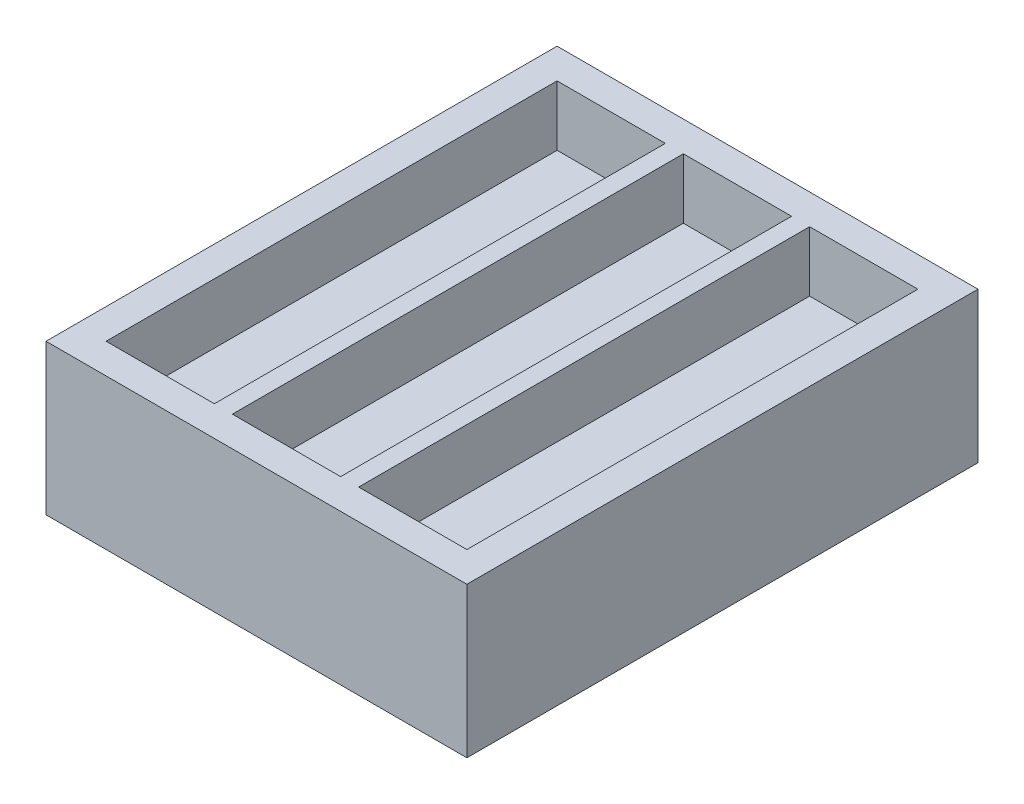
ISO-10303-21;
HEADER;
FILE_DESCRIPTION(('STEP AP214'),'2;1');
FILE_NAME('part.step','',(''),(''),'','','');
FILE_SCHEMA(('AUTOMOTIVE_DESIGN { 1 0 10303 214 1 1 1 1 }'));
ENDSEC;
DATA;
#1=APPLICATION_CONTEXT('core data for automotive mechanical design processes');
#2=APPLICATION_PROTOCOL_DEFINITION('international standard','automotive_design',2000,#1);
#3=PRODUCT_CONTEXT('',#1,'mechanical');
#4=PRODUCT('Part','Part','',(#3));
#5=PRODUCT_RELATED_PRODUCT_CATEGORY('part','',(#4));
#6=PRODUCT_DEFINITION_FORMATION('','',#4);
#7=PRODUCT_DEFINITION_CONTEXT('part definition',#1,'design');
#8=PRODUCT_DEFINITION('design','',#6,#7);
#9=PRODUCT_DEFINITION_SHAPE('','',#8);
#10=(LENGTH_UNIT() NAMED_UNIT(*) SI_UNIT(.MILLI.,.METRE.));
#11=(NAMED_UNIT(*) PLANE_ANGLE_UNIT() SI_UNIT($,.RADIAN.));
#12=(NAMED_UNIT(*) SI_UNIT($,.STERADIAN.) SOLID_ANGLE_UNIT());
#13=UNCERTAINTY_MEASURE_WITH_UNIT(LENGTH_MEASURE(1.E-05),#10,'distance_accuracy_value','');
#14=(GEOMETRIC_REPRESENTATION_CONTEXT(3) GLOBAL_UNCERTAINTY_ASSIGNED_CONTEXT((#13)) GLOBAL_UNIT_ASSIGNED_CONTEXT((#10,
#11,#12)) REPRESENTATION_CONTEXT('',''));
#15=CARTESIAN_POINT('',(0.,0.,0.));
#16=DIRECTION('',(0.,0.,1.));
#17=DIRECTION('',(1.,0.,0.));
#18=AXIS2_PLACEMENT_3D('',#15,#16,#17);
#19=CARTESIAN_POINT('',(35.,25.,42.5));
#20=DIRECTION('',(-1.,0.,0.));
#21=DIRECTION('',(0.,0.,1.));
#22=AXIS2_PLACEMENT_3D('',#19,#20,#21);
#23=PLANE('',#22);
#24=DIRECTION('',(0.,0.,-1.));
#25=VECTOR('',#24,1.);
#26=CARTESIAN_POINT('',(35.,0.,42.5));
#27=LINE('',#26,#25);
#28=CARTESIAN_POINT('',(35.,0.,42.5));
#29=VERTEX_POINT('',#28);
#30=CARTESIAN_POINT('',(35.,0.,-42.5));
#31=VERTEX_POINT('',#30);
#32=EDGE_CURVE('E184',#29,#31,#27,.T.);
#33=ORIENTED_EDGE('',*,*,#32,.T.);
#34=DIRECTION('',(0.,-1.,0.));
#35=VECTOR('',#34,1.);
#36=CARTESIAN_POINT('',(35.,25.,-42.5));
#37=LINE('',#36,#35);
#38=CARTESIAN_POINT('',(35.,25.,-42.5));
#39=VERTEX_POINT('',#38);
#40=EDGE_CURVE('E11',#39,#31,#37,.T.);
#41=ORIENTED_EDGE('',*,*,#40,.F.);
#42=DIRECTION('',(0.,0.,-1.));
#43=VECTOR('',#42,1.);
#44=CARTESIAN_POINT('',(35.,25.,42.5));
#45=LINE('',#44,#43);
#46=CARTESIAN_POINT('',(35.,25.,42.5));
#47=VERTEX_POINT('',#46);
#48=EDGE_CURVE('E250',#47,#39,#45,.T.);
#49=ORIENTED_EDGE('',*,*,#48,.F.);
#50=DIRECTION('',(0.,-1.,0.));
#51=VECTOR('',#50,1.);
#52=CARTESIAN_POINT('',(35.,25.,42.5));
#53=LINE('',#52,#51);
#54=EDGE_CURVE('E260',#47,#29,#53,.T.);
#55=ORIENTED_EDGE('',*,*,#54,.T.);
#56=EDGE_LOOP('',(#33,#41,#49,#55));
#57=FACE_BOUND('',#56,.T.);
#58=ADVANCED_FACE('F37',(#57),#23,.F.);
#59=CARTESIAN_POINT('',(-35.,25.,-42.5));
#60=DIRECTION('',(0.,0.,1.));
#61=DIRECTION('',(1.,0.,0.));
#62=AXIS2_PLACEMENT_3D('',#59,#60,#61);
#63=PLANE('',#62);
#64=DIRECTION('',(-1.,0.,0.));
#65=VECTOR('',#64,1.);
#66=CARTESIAN_POINT('',(-35.,0.,-42.5));
#67=LINE('',#66,#65);
#68=CARTESIAN_POINT('',(-35.,0.,-42.5));
#69=VERTEX_POINT('',#68);
#70=EDGE_CURVE('E263',#31,#69,#67,.T.);
#71=ORIENTED_EDGE('',*,*,#70,.T.);
#72=DIRECTION('',(0.,-1.,0.));
#73=VECTOR('',#72,1.);
#74=CARTESIAN_POINT('',(-35.,25.,-42.5));
#75=LINE('',#74,#73);
#76=CARTESIAN_POINT('',(-35.,25.,-42.5));
#77=VERTEX_POINT('',#76);
#78=EDGE_CURVE('E44',#77,#69,#75,.T.);
#79=ORIENTED_EDGE('',*,*,#78,.F.);
#80=DIRECTION('',(-1.,0.,0.));
#81=VECTOR('',#80,1.);
#82=CARTESIAN_POINT('',(-35.,25.,-42.5));
#83=LINE('',#82,#81);
#84=EDGE_CURVE('E253',#39,#77,#83,.T.);
#85=ORIENTED_EDGE('',*,*,#84,.F.);
#86=ORIENTED_EDGE('',*,*,#40,.T.);
#87=EDGE_LOOP('',(#71,#79,#85,#86));
#88=FACE_BOUND('',#87,.T.);
#89=ADVANCED_FACE('F293',(#88),#63,.F.);
#90=CARTESIAN_POINT('',(-35.,25.,42.5));
#91=DIRECTION('',(1.,0.,0.));
#92=DIRECTION('',(0.,0.,-1.));
#93=AXIS2_PLACEMENT_3D('',#90,#91,#92);
#94=PLANE('',#93);
#95=DIRECTION('',(0.,0.,1.));
#96=VECTOR('',#95,1.);
#97=CARTESIAN_POINT('',(-35.,0.,42.5));
#98=LINE('',#97,#96);
#99=CARTESIAN_POINT('',(-35.,0.,42.5));
#100=VERTEX_POINT('',#99);
#101=EDGE_CURVE('E265',#69,#100,#98,.T.);
#102=ORIENTED_EDGE('',*,*,#101,.T.);
#103=DIRECTION('',(0.,-1.,0.));
#104=VECTOR('',#103,1.);
#105=CARTESIAN_POINT('',(-35.,25.,42.5));
#106=LINE('',#105,#104);
#107=CARTESIAN_POINT('',(-35.,25.,42.5));
#108=VERTEX_POINT('',#107);
#109=EDGE_CURVE('E270',#108,#100,#106,.T.);
#110=ORIENTED_EDGE('',*,*,#109,.F.);
#111=DIRECTION('',(0.,0.,1.));
#112=VECTOR('',#111,1.);
#113=CARTESIAN_POINT('',(-35.,25.,42.5));
#114=LINE('',#113,#112);
#115=EDGE_CURVE('E256',#77,#108,#114,.T.);
#116=ORIENTED_EDGE('',*,*,#115,.F.);
#117=ORIENTED_EDGE('',*,*,#78,.T.);
#118=EDGE_LOOP('',(#102,#110,#116,#117));
#119=FACE_BOUND('',#118,.T.);
#120=ADVANCED_FACE('F277',(#119),#94,.F.);
#121=CARTESIAN_POINT('',(-35.,25.,42.5));
#122=DIRECTION('',(0.,0.,-1.));
#123=DIRECTION('',(-1.,0.,0.));
#124=AXIS2_PLACEMENT_3D('',#121,#122,#123);
#125=PLANE('',#124);
#126=DIRECTION('',(1.,0.,0.));
#127=VECTOR('',#126,1.);
#128=CARTESIAN_POINT('',(-35.,0.,42.5));
#129=LINE('',#128,#127);
#130=EDGE_CURVE('E254',#100,#29,#129,.T.);
#131=ORIENTED_EDGE('',*,*,#130,.T.);
#132=ORIENTED_EDGE('',*,*,#54,.F.);
#133=DIRECTION('',(1.,0.,0.));
#134=VECTOR('',#133,1.);
#135=CARTESIAN_POINT('',(-35.,25.,42.5));
#136=LINE('',#135,#134);
#137=EDGE_CURVE('E258',#108,#47,#136,.T.);
#138=ORIENTED_EDGE('',*,*,#137,.F.);
#139=ORIENTED_EDGE('',*,*,#109,.T.);
#140=EDGE_LOOP('',(#131,#132,#138,#139));
#141=FACE_BOUND('',#140,.T.);
#142=ADVANCED_FACE('F286',(#141),#125,.F.);
#143=CARTESIAN_POINT('',(0.,25.,0.));
#144=DIRECTION('',(0.,-1.,0.));
#145=DIRECTION('',(0.,0.,-1.));
#146=AXIS2_PLACEMENT_3D('',#143,#144,#145);
#147=PLANE('',#146);
#148=DIRECTION('',(1.,0.,0.));
#149=VECTOR('',#148,1.);
#150=CARTESIAN_POINT('',(-30.,25.,37.5));
#151=LINE('',#150,#149);
#152=CARTESIAN_POINT('',(-30.,25.,37.5));
#153=VERTEX_POINT('',#152);
#154=CARTESIAN_POINT('',(-12.,25.,37.5));
#155=VERTEX_POINT('',#154);
#156=EDGE_CURVE('E178',#153,#155,#151,.T.);
#157=ORIENTED_EDGE('',*,*,#156,.F.);
#158=DIRECTION('',(0.,0.,1.));
#159=VECTOR('',#158,1.);
#160=CARTESIAN_POINT('',(-30.,25.,-37.5));
#161=LINE('',#160,#159);
#162=CARTESIAN_POINT('',(-30.,25.,-37.5));
#163=VERTEX_POINT('',#162);
#164=EDGE_CURVE('E51',#163,#153,#161,.T.);
#165=ORIENTED_EDGE('',*,*,#164,.F.);
#166=DIRECTION('',(-1.,0.,0.));
#167=VECTOR('',#166,1.);
#168=CARTESIAN_POINT('',(-30.,25.,-37.5));
#169=LINE('',#168,#167);
#170=CARTESIAN_POINT('',(-12.,25.,-37.5));
#171=VERTEX_POINT('',#170);
#172=EDGE_CURVE('E169',#171,#163,#169,.T.);
#173=ORIENTED_EDGE('',*,*,#172,.F.);
#174=DIRECTION('',(0.,0.,-1.));
#175=VECTOR('',#174,1.);
#176=CARTESIAN_POINT('',(-12.,25.,-37.5));
#177=LINE('',#176,#175);
#178=EDGE_CURVE('E172',#155,#171,#177,.T.);
#179=ORIENTED_EDGE('',*,*,#178,.F.);
#180=EDGE_LOOP('',(#157,#165,#173,#179));
#181=FACE_BOUND('',#180,.T.);
#182=DIRECTION('',(0.,0.,1.));
#183=VECTOR('',#182,1.);
#184=CARTESIAN_POINT('',(-8.99999999999999,25.,-37.5));
#185=LINE('',#184,#183);
#186=CARTESIAN_POINT('',(-8.99999999999999,25.,-37.5));
#187=VERTEX_POINT('',#186);
#188=CARTESIAN_POINT('',(-8.99999999999998,25.,37.5));
#189=VERTEX_POINT('',#188);
#190=EDGE_CURVE('E205',#187,#189,#185,.T.);
#191=ORIENTED_EDGE('',*,*,#190,.F.);
#192=DIRECTION('',(-1.,0.,0.));
#193=VECTOR('',#192,1.);
#194=CARTESIAN_POINT('',(-8.99999999999999,25.,-37.5));
#195=LINE('',#194,#193);
#196=CARTESIAN_POINT('',(9.00000000000001,25.,-37.5));
#197=VERTEX_POINT('',#196);
#198=EDGE_CURVE('E59',#197,#187,#195,.T.);
#199=ORIENTED_EDGE('',*,*,#198,.F.);
#200=DIRECTION('',(0.,0.,-1.));
#201=VECTOR('',#200,1.);
#202=CARTESIAN_POINT('',(9.00000000000001,25.,-37.5));
#203=LINE('',#202,#201);
#204=CARTESIAN_POINT('',(9.00000000000002,25.,37.5));
#205=VERTEX_POINT('',#204);
#206=EDGE_CURVE('E198',#205,#197,#203,.T.);
#207=ORIENTED_EDGE('',*,*,#206,.F.);
#208=DIRECTION('',(1.,0.,0.));
#209=VECTOR('',#208,1.);
#210=CARTESIAN_POINT('',(-8.99999999999998,25.,37.5));
#211=LINE('',#210,#209);
#212=EDGE_CURVE('E201',#189,#205,#211,.T.);
#213=ORIENTED_EDGE('',*,*,#212,.F.);
#214=EDGE_LOOP('',(#191,#199,#207,#213));
#215=FACE_BOUND('',#214,.T.);
#216=DIRECTION('',(0.,0.,1.));
#217=VECTOR('',#216,1.);
#218=CARTESIAN_POINT('',(12.,25.,-37.5));
#219=LINE('',#218,#217);
#220=CARTESIAN_POINT('',(12.,25.,-37.5));
#221=VERTEX_POINT('',#220);
#222=CARTESIAN_POINT('',(12.,25.,37.5));
#223=VERTEX_POINT('',#222);
#224=EDGE_CURVE('E236',#221,#223,#219,.T.);
#225=ORIENTED_EDGE('',*,*,#224,.F.);
#226=DIRECTION('',(-1.,0.,0.));
#227=VECTOR('',#226,1.);
#228=CARTESIAN_POINT('',(12.,25.,-37.5));
#229=LINE('',#228,#227);
#230=CARTESIAN_POINT('',(30.,25.,-37.5));
#231=VERTEX_POINT('',#230);
#232=EDGE_CURVE('E197',#231,#221,#229,.T.);
#233=ORIENTED_EDGE('',*,*,#232,.F.);
#234=DIRECTION('',(0.,0.,-1.));
#235=VECTOR('',#234,1.);
#236=CARTESIAN_POINT('',(30.,25.,-37.5));
#237=LINE('',#236,#235);
#238=CARTESIAN_POINT('',(30.,25.,37.5));
#239=VERTEX_POINT('',#238);
#240=EDGE_CURVE('E229',#239,#231,#237,.T.);
#241=ORIENTED_EDGE('',*,*,#240,.F.);
#242=DIRECTION('',(1.,0.,0.));
#243=VECTOR('',#242,1.);
#244=CARTESIAN_POINT('',(12.,25.,37.5));
#245=LINE('',#244,#243);
#246=EDGE_CURVE('E232',#223,#239,#245,.T.);
#247=ORIENTED_EDGE('',*,*,#246,.F.);
#248=EDGE_LOOP('',(#225,#233,#241,#247));
#249=FACE_BOUND('',#248,.T.);
#250=ORIENTED_EDGE('',*,*,#48,.T.);
#251=ORIENTED_EDGE('',*,*,#84,.T.);
#252=ORIENTED_EDGE('',*,*,#115,.T.);
#253=ORIENTED_EDGE('',*,*,#137,.T.);
#254=EDGE_LOOP('',(#250,#251,#252,#253));
#255=FACE_BOUND('',#254,.T.);
#256=ADVANCED_FACE('F292',(#181,#215,#249,#255),#147,.F.);
#257=CARTESIAN_POINT('',(0.,0.,0.));
#258=DIRECTION('',(0.,-1.,0.));
#259=DIRECTION('',(0.,0.,-1.));
#260=AXIS2_PLACEMENT_3D('',#257,#258,#259);
#261=PLANE('',#260);
#262=ORIENTED_EDGE('',*,*,#32,.F.);
#263=ORIENTED_EDGE('',*,*,#130,.F.);
#264=ORIENTED_EDGE('',*,*,#101,.F.);
#265=ORIENTED_EDGE('',*,*,#70,.F.);
#266=EDGE_LOOP('',(#262,#263,#264,#265));
#267=FACE_BOUND('',#266,.T.);
#268=ADVANCED_FACE('F283',(#267),#261,.T.);
#269=CARTESIAN_POINT('',(12.,15.,-37.5));
#270=DIRECTION('',(0.,0.,-1.));
#271=DIRECTION('',(-1.,0.,0.));
#272=AXIS2_PLACEMENT_3D('',#269,#270,#271);
#273=PLANE('',#272);
#274=ORIENTED_EDGE('',*,*,#232,.T.);
#275=DIRECTION('',(0.,1.,0.));
#276=VECTOR('',#275,1.);
#277=CARTESIAN_POINT('',(12.,15.,-37.5));
#278=LINE('',#277,#276);
#279=CARTESIAN_POINT('',(12.,15.,-37.5));
#280=VERTEX_POINT('',#279);
#281=EDGE_CURVE('E219',#280,#221,#278,.T.);
#282=ORIENTED_EDGE('',*,*,#281,.F.);
#283=DIRECTION('',(-1.,0.,0.));
#284=VECTOR('',#283,1.);
#285=CARTESIAN_POINT('',(12.,15.,-37.5));
#286=LINE('',#285,#284);
#287=CARTESIAN_POINT('',(30.,15.,-37.5));
#288=VERTEX_POINT('',#287);
#289=EDGE_CURVE('E233',#288,#280,#286,.T.);
#290=ORIENTED_EDGE('',*,*,#289,.F.);
#291=DIRECTION('',(0.,1.,0.));
#292=VECTOR('',#291,1.);
#293=CARTESIAN_POINT('',(30.,15.,-37.5));
#294=LINE('',#293,#292);
#295=EDGE_CURVE('E227',#288,#231,#294,.T.);
#296=ORIENTED_EDGE('',*,*,#295,.T.);
#297=EDGE_LOOP('',(#274,#282,#290,#296));
#298=FACE_BOUND('',#297,.T.);
#299=ADVANCED_FACE('F305',(#298),#273,.F.);
#300=CARTESIAN_POINT('',(30.,15.,-37.5));
#301=DIRECTION('',(1.,0.,0.));
#302=DIRECTION('',(0.,0.,-1.));
#303=AXIS2_PLACEMENT_3D('',#300,#301,#302);
#304=PLANE('',#303);
#305=ORIENTED_EDGE('',*,*,#240,.T.);
#306=ORIENTED_EDGE('',*,*,#295,.F.);
#307=DIRECTION('',(0.,0.,-1.));
#308=VECTOR('',#307,1.);
#309=CARTESIAN_POINT('',(30.,15.,-37.5));
#310=LINE('',#309,#308);
#311=CARTESIAN_POINT('',(30.,15.,37.5));
#312=VERTEX_POINT('',#311);
#313=EDGE_CURVE('E222',#312,#288,#310,.T.);
#314=ORIENTED_EDGE('',*,*,#313,.F.);
#315=DIRECTION('',(0.,1.,0.));
#316=VECTOR('',#315,1.);
#317=CARTESIAN_POINT('',(30.,15.,37.5));
#318=LINE('',#317,#316);
#319=EDGE_CURVE('E225',#312,#239,#318,.T.);
#320=ORIENTED_EDGE('',*,*,#319,.T.);
#321=EDGE_LOOP('',(#305,#306,#314,#320));
#322=FACE_BOUND('',#321,.T.);
#323=ADVANCED_FACE('F315',(#322),#304,.F.);
#324=CARTESIAN_POINT('',(12.,15.,37.5));
#325=DIRECTION('',(0.,0.,1.));
#326=DIRECTION('',(1.,0.,0.));
#327=AXIS2_PLACEMENT_3D('',#324,#325,#326);
#328=PLANE('',#327);
#329=ORIENTED_EDGE('',*,*,#246,.T.);
#330=ORIENTED_EDGE('',*,*,#319,.F.);
#331=DIRECTION('',(1.,0.,0.));
#332=VECTOR('',#331,1.);
#333=CARTESIAN_POINT('',(12.,15.,37.5));
#334=LINE('',#333,#332);
#335=CARTESIAN_POINT('',(12.,15.,37.5));
#336=VERTEX_POINT('',#335);
#337=EDGE_CURVE('E242',#336,#312,#334,.T.);
#338=ORIENTED_EDGE('',*,*,#337,.F.);
#339=DIRECTION('',(0.,1.,0.));
#340=VECTOR('',#339,1.);
#341=CARTESIAN_POINT('',(12.,15.,37.5));
#342=LINE('',#341,#340);
#343=EDGE_CURVE('E223',#336,#223,#342,.T.);
#344=ORIENTED_EDGE('',*,*,#343,.T.);
#345=EDGE_LOOP('',(#329,#330,#338,#344));
#346=FACE_BOUND('',#345,.T.);
#347=ADVANCED_FACE('F318',(#346),#328,.F.);
#348=CARTESIAN_POINT('',(12.,15.,-37.5));
#349=DIRECTION('',(-1.,0.,0.));
#350=DIRECTION('',(0.,0.,1.));
#351=AXIS2_PLACEMENT_3D('',#348,#349,#350);
#352=PLANE('',#351);
#353=ORIENTED_EDGE('',*,*,#224,.T.);
#354=ORIENTED_EDGE('',*,*,#343,.F.);
#355=DIRECTION('',(0.,0.,1.));
#356=VECTOR('',#355,1.);
#357=CARTESIAN_POINT('',(12.,15.,-37.5));
#358=LINE('',#357,#356);
#359=EDGE_CURVE('E245',#280,#336,#358,.T.);
#360=ORIENTED_EDGE('',*,*,#359,.F.);
#361=ORIENTED_EDGE('',*,*,#281,.T.);
#362=EDGE_LOOP('',(#353,#354,#360,#361));
#363=FACE_BOUND('',#362,.T.);
#364=ADVANCED_FACE('F313',(#363),#352,.F.);
#365=CARTESIAN_POINT('',(0.,15.,0.));
#366=DIRECTION('',(0.,-1.,0.));
#367=DIRECTION('',(0.,0.,-1.));
#368=AXIS2_PLACEMENT_3D('',#365,#366,#367);
#369=PLANE('',#368);
#370=ORIENTED_EDGE('',*,*,#289,.T.);
#371=ORIENTED_EDGE('',*,*,#359,.T.);
#372=ORIENTED_EDGE('',*,*,#337,.T.);
#373=ORIENTED_EDGE('',*,*,#313,.T.);
#374=EDGE_LOOP('',(#370,#371,#372,#373));
#375=FACE_BOUND('',#374,.T.);
#376=ADVANCED_FACE('F309',(#375),#369,.F.);
#377=CARTESIAN_POINT('',(-8.99999999999999,15.,-37.5));
#378=DIRECTION('',(0.,0.,-1.));
#379=DIRECTION('',(-1.,0.,0.));
#380=AXIS2_PLACEMENT_3D('',#377,#378,#379);
#381=PLANE('',#380);
#382=ORIENTED_EDGE('',*,*,#198,.T.);
#383=DIRECTION('',(0.,1.,0.));
#384=VECTOR('',#383,1.);
#385=CARTESIAN_POINT('',(-8.99999999999999,15.,-37.5));
#386=LINE('',#385,#384);
#387=CARTESIAN_POINT('',(-8.99999999999999,15.,-37.5));
#388=VERTEX_POINT('',#387);
#389=EDGE_CURVE('E188',#388,#187,#386,.T.);
#390=ORIENTED_EDGE('',*,*,#389,.F.);
#391=DIRECTION('',(-1.,0.,0.));
#392=VECTOR('',#391,1.);
#393=CARTESIAN_POINT('',(-8.99999999999999,15.,-37.5));
#394=LINE('',#393,#392);
#395=CARTESIAN_POINT('',(9.00000000000001,15.,-37.5));
#396=VERTEX_POINT('',#395);
#397=EDGE_CURVE('E202',#396,#388,#394,.T.);
#398=ORIENTED_EDGE('',*,*,#397,.F.);
#399=DIRECTION('',(0.,1.,0.));
#400=VECTOR('',#399,1.);
#401=CARTESIAN_POINT('',(9.00000000000001,15.,-37.5));
#402=LINE('',#401,#400);
#403=EDGE_CURVE('E195',#396,#197,#402,.T.);
#404=ORIENTED_EDGE('',*,*,#403,.T.);
#405=EDGE_LOOP('',(#382,#390,#398,#404));
#406=FACE_BOUND('',#405,.T.);
#407=ADVANCED_FACE('F312',(#406),#381,.F.);
#408=CARTESIAN_POINT('',(9.00000000000001,15.,-37.5));
#409=DIRECTION('',(1.,0.,0.));
#410=DIRECTION('',(0.,0.,-1.));
#411=AXIS2_PLACEMENT_3D('',#408,#409,#410);
#412=PLANE('',#411);
#413=ORIENTED_EDGE('',*,*,#206,.T.);
#414=ORIENTED_EDGE('',*,*,#403,.F.);
#415=DIRECTION('',(0.,0.,-1.));
#416=VECTOR('',#415,1.);
#417=CARTESIAN_POINT('',(9.00000000000001,15.,-37.5));
#418=LINE('',#417,#416);
#419=CARTESIAN_POINT('',(9.00000000000002,15.,37.5));
#420=VERTEX_POINT('',#419);
#421=EDGE_CURVE('E190',#420,#396,#418,.T.);
#422=ORIENTED_EDGE('',*,*,#421,.F.);
#423=DIRECTION('',(0.,1.,0.));
#424=VECTOR('',#423,1.);
#425=CARTESIAN_POINT('',(9.00000000000002,15.,37.5));
#426=LINE('',#425,#424);
#427=EDGE_CURVE('E193',#420,#205,#426,.T.);
#428=ORIENTED_EDGE('',*,*,#427,.T.);
#429=EDGE_LOOP('',(#413,#414,#422,#428));
#430=FACE_BOUND('',#429,.T.);
#431=ADVANCED_FACE('F334',(#430),#412,.F.);
#432=CARTESIAN_POINT('',(-8.99999999999998,15.,37.5));
#433=DIRECTION('',(0.,0.,1.));
#434=DIRECTION('',(1.,0.,0.));
#435=AXIS2_PLACEMENT_3D('',#432,#433,#434);
#436=PLANE('',#435);
#437=ORIENTED_EDGE('',*,*,#212,.T.);
#438=ORIENTED_EDGE('',*,*,#427,.F.);
#439=DIRECTION('',(1.,0.,0.));
#440=VECTOR('',#439,1.);
#441=CARTESIAN_POINT('',(-8.99999999999998,15.,37.5));
#442=LINE('',#441,#440);
#443=CARTESIAN_POINT('',(-8.99999999999998,15.,37.5));
#444=VERTEX_POINT('',#443);
#445=EDGE_CURVE('E211',#444,#420,#442,.T.);
#446=ORIENTED_EDGE('',*,*,#445,.F.);
#447=DIRECTION('',(0.,1.,0.));
#448=VECTOR('',#447,1.);
#449=CARTESIAN_POINT('',(-8.99999999999998,15.,37.5));
#450=LINE('',#449,#448);
#451=EDGE_CURVE('E191',#444,#189,#450,.T.);
#452=ORIENTED_EDGE('',*,*,#451,.T.);
#453=EDGE_LOOP('',(#437,#438,#446,#452));
#454=FACE_BOUND('',#453,.T.);
#455=ADVANCED_FACE('F337',(#454),#436,.F.);
#456=CARTESIAN_POINT('',(-8.99999999999999,15.,-37.5));
#457=DIRECTION('',(-1.,0.,0.));
#458=DIRECTION('',(0.,0.,1.));
#459=AXIS2_PLACEMENT_3D('',#456,#457,#458);
#460=PLANE('',#459);
#461=ORIENTED_EDGE('',*,*,#190,.T.);
#462=ORIENTED_EDGE('',*,*,#451,.F.);
#463=DIRECTION('',(0.,0.,1.));
#464=VECTOR('',#463,1.);
#465=CARTESIAN_POINT('',(-8.99999999999999,15.,-37.5));
#466=LINE('',#465,#464);
#467=EDGE_CURVE('E214',#388,#444,#466,.T.);
#468=ORIENTED_EDGE('',*,*,#467,.F.);
#469=ORIENTED_EDGE('',*,*,#389,.T.);
#470=EDGE_LOOP('',(#461,#462,#468,#469));
#471=FACE_BOUND('',#470,.T.);
#472=ADVANCED_FACE('F332',(#471),#460,.F.);
#473=CARTESIAN_POINT('',(0.,15.,0.));
#474=DIRECTION('',(0.,-1.,0.));
#475=DIRECTION('',(0.,0.,-1.));
#476=AXIS2_PLACEMENT_3D('',#473,#474,#475);
#477=PLANE('',#476);
#478=ORIENTED_EDGE('',*,*,#397,.T.);
#479=ORIENTED_EDGE('',*,*,#467,.T.);
#480=ORIENTED_EDGE('',*,*,#445,.T.);
#481=ORIENTED_EDGE('',*,*,#421,.T.);
#482=EDGE_LOOP('',(#478,#479,#480,#481));
#483=FACE_BOUND('',#482,.T.);
#484=ADVANCED_FACE('F329',(#483),#477,.F.);
#485=CARTESIAN_POINT('',(-30.,15.,-37.5));
#486=DIRECTION('',(-1.,0.,0.));
#487=DIRECTION('',(0.,0.,1.));
#488=AXIS2_PLACEMENT_3D('',#485,#486,#487);
#489=PLANE('',#488);
#490=ORIENTED_EDGE('',*,*,#164,.T.);
#491=DIRECTION('',(0.,1.,0.));
#492=VECTOR('',#491,1.);
#493=CARTESIAN_POINT('',(-30.,15.,37.5));
#494=LINE('',#493,#492);
#495=CARTESIAN_POINT('',(-30.,15.,37.5));
#496=VERTEX_POINT('',#495);
#497=EDGE_CURVE('E147',#496,#153,#494,.T.);
#498=ORIENTED_EDGE('',*,*,#497,.F.);
#499=DIRECTION('',(0.,0.,1.));
#500=VECTOR('',#499,1.);
#501=CARTESIAN_POINT('',(-30.,15.,-37.5));
#502=LINE('',#501,#500);
#503=CARTESIAN_POINT('',(-30.,15.,-37.5));
#504=VERTEX_POINT('',#503);
#505=EDGE_CURVE('E151',#504,#496,#502,.T.);
#506=ORIENTED_EDGE('',*,*,#505,.F.);
#507=DIRECTION('',(0.,1.,0.));
#508=VECTOR('',#507,1.);
#509=CARTESIAN_POINT('',(-30.,15.,-37.5));
#510=LINE('',#509,#508);
#511=EDGE_CURVE('E182',#504,#163,#510,.T.);
#512=ORIENTED_EDGE('',*,*,#511,.T.);
#513=EDGE_LOOP('',(#490,#498,#506,#512));
#514=FACE_BOUND('',#513,.T.);
#515=ADVANCED_FACE('F149',(#514),#489,.F.);
#516=CARTESIAN_POINT('',(-30.,15.,-37.5));
#517=DIRECTION('',(0.,0.,-1.));
#518=DIRECTION('',(-1.,0.,0.));
#519=AXIS2_PLACEMENT_3D('',#516,#517,#518);
#520=PLANE('',#519);
#521=ORIENTED_EDGE('',*,*,#172,.T.);
#522=ORIENTED_EDGE('',*,*,#511,.F.);
#523=DIRECTION('',(-1.,0.,0.));
#524=VECTOR('',#523,1.);
#525=CARTESIAN_POINT('',(-30.,15.,-37.5));
#526=LINE('',#525,#524);
#527=CARTESIAN_POINT('',(-12.,15.,-37.5));
#528=VERTEX_POINT('',#527);
#529=EDGE_CURVE('E157',#528,#504,#526,.T.);
#530=ORIENTED_EDGE('',*,*,#529,.F.);
#531=DIRECTION('',(0.,1.,0.));
#532=VECTOR('',#531,1.);
#533=CARTESIAN_POINT('',(-12.,15.,-37.5));
#534=LINE('',#533,#532);
#535=EDGE_CURVE('E185',#528,#171,#534,.T.);
#536=ORIENTED_EDGE('',*,*,#535,.T.);
#537=EDGE_LOOP('',(#521,#522,#530,#536));
#538=FACE_BOUND('',#537,.T.);
#539=ADVANCED_FACE('F349',(#538),#520,.F.);
#540=CARTESIAN_POINT('',(-12.,15.,-37.5));
#541=DIRECTION('',(1.,0.,0.));
#542=DIRECTION('',(0.,0.,-1.));
#543=AXIS2_PLACEMENT_3D('',#540,#541,#542);
#544=PLANE('',#543);
#545=ORIENTED_EDGE('',*,*,#178,.T.);
#546=ORIENTED_EDGE('',*,*,#535,.F.);
#547=DIRECTION('',(0.,0.,-1.));
#548=VECTOR('',#547,1.);
#549=CARTESIAN_POINT('',(-12.,15.,-37.5));
#550=LINE('',#549,#548);
#551=CARTESIAN_POINT('',(-12.,15.,37.5));
#552=VERTEX_POINT('',#551);
#553=EDGE_CURVE('E165',#552,#528,#550,.T.);
#554=ORIENTED_EDGE('',*,*,#553,.F.);
#555=DIRECTION('',(0.,1.,0.));
#556=VECTOR('',#555,1.);
#557=CARTESIAN_POINT('',(-12.,15.,37.5));
#558=LINE('',#557,#556);
#559=EDGE_CURVE('E156',#552,#155,#558,.T.);
#560=ORIENTED_EDGE('',*,*,#559,.T.);
#561=EDGE_LOOP('',(#545,#546,#554,#560));
#562=FACE_BOUND('',#561,.T.);
#563=ADVANCED_FACE('F352',(#562),#544,.F.);
#564=CARTESIAN_POINT('',(-30.,15.,37.5));
#565=DIRECTION('',(0.,0.,1.));
#566=DIRECTION('',(1.,0.,0.));
#567=AXIS2_PLACEMENT_3D('',#564,#565,#566);
#568=PLANE('',#567);
#569=ORIENTED_EDGE('',*,*,#156,.T.);
#570=ORIENTED_EDGE('',*,*,#559,.F.);
#571=DIRECTION('',(1.,0.,0.));
#572=VECTOR('',#571,1.);
#573=CARTESIAN_POINT('',(-30.,15.,37.5));
#574=LINE('',#573,#572);
#575=EDGE_CURVE('E160',#496,#552,#574,.T.);
#576=ORIENTED_EDGE('',*,*,#575,.F.);
#577=ORIENTED_EDGE('',*,*,#497,.T.);
#578=EDGE_LOOP('',(#569,#570,#576,#577));
#579=FACE_BOUND('',#578,.T.);
#580=ADVANCED_FACE('F161',(#579),#568,.F.);
#581=CARTESIAN_POINT('',(0.,15.,0.));
#582=DIRECTION('',(0.,1.,0.));
#583=DIRECTION('',(0.,0.,1.));
#584=AXIS2_PLACEMENT_3D('',#581,#582,#583);
#585=PLANE('',#584);
#586=ORIENTED_EDGE('',*,*,#505,.T.);
#587=ORIENTED_EDGE('',*,*,#575,.T.);
#588=ORIENTED_EDGE('',*,*,#553,.T.);
#589=ORIENTED_EDGE('',*,*,#529,.T.);
#590=EDGE_LOOP('',(#586,#587,#588,#589));
#591=FACE_BOUND('',#590,.T.);
#592=ADVANCED_FACE('F167',(#591),#585,.T.);
#593=CLOSED_SHELL('',(#58,#89,#120,#142,#256,#268,#299,#323,#347,#364,#376,#407,#431,#455,#472,
#484,#515,#539,#563,#580,#592));
#594=MANIFOLD_SOLID_BREP('B2',#593);
#595=ADVANCED_BREP_SHAPE_REPRESENTATION('',(#18,#594),#14);
#596=SHAPE_DEFINITION_REPRESENTATION(#9,#595);
ENDSEC;
END-ISO-10303-21;
